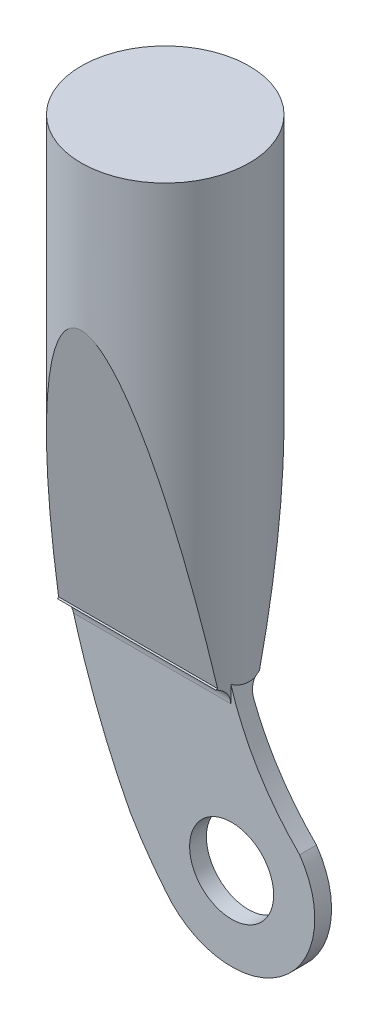
ISO-10303-21;
HEADER;
FILE_DESCRIPTION(('STEP AP214'),'2;1');
FILE_NAME('part.step','',(''),(''),'','','');
FILE_SCHEMA(('AUTOMOTIVE_DESIGN { 1 0 10303 214 1 1 1 1 }'));
ENDSEC;
DATA;
#1=APPLICATION_CONTEXT('core data for automotive mechanical design processes');
#2=APPLICATION_PROTOCOL_DEFINITION('international standard','automotive_design',2000,#1);
#3=PRODUCT_CONTEXT('',#1,'mechanical');
#4=PRODUCT('Part','Part','',(#3));
#5=PRODUCT_RELATED_PRODUCT_CATEGORY('part','',(#4));
#6=PRODUCT_DEFINITION_FORMATION('','',#4);
#7=PRODUCT_DEFINITION_CONTEXT('part definition',#1,'design');
#8=PRODUCT_DEFINITION('design','',#6,#7);
#9=PRODUCT_DEFINITION_SHAPE('','',#8);
#10=(LENGTH_UNIT() NAMED_UNIT(*) SI_UNIT(.MILLI.,.METRE.));
#11=(NAMED_UNIT(*) PLANE_ANGLE_UNIT() SI_UNIT($,.RADIAN.));
#12=(NAMED_UNIT(*) SI_UNIT($,.STERADIAN.) SOLID_ANGLE_UNIT());
#13=UNCERTAINTY_MEASURE_WITH_UNIT(LENGTH_MEASURE(1.E-05),#10,'distance_accuracy_value','');
#14=(GEOMETRIC_REPRESENTATION_CONTEXT(3) GLOBAL_UNCERTAINTY_ASSIGNED_CONTEXT((#13)) GLOBAL_UNIT_ASSIGNED_CONTEXT((#10,
#11,#12)) REPRESENTATION_CONTEXT('',''));
#15=CARTESIAN_POINT('',(0.,0.,0.));
#16=DIRECTION('',(0.,0.,1.));
#17=DIRECTION('',(1.,0.,0.));
#18=AXIS2_PLACEMENT_3D('',#15,#16,#17);
#19=CARTESIAN_POINT('',(0.,91.44,0.));
#20=DIRECTION('',(0.,-1.,0.));
#21=DIRECTION('',(0.,0.,-1.));
#22=AXIS2_PLACEMENT_3D('',#19,#20,#21);
#23=CYLINDRICAL_SURFACE('',#22,12.7);
#24=CARTESIAN_POINT('',(-11.9792612428708,24.1925238713067,4.21749926793753));
#25=CARTESIAN_POINT('',(-11.9544595647798,24.2179719688314,4.28796554173861));
#26=CARTESIAN_POINT('',(-11.9286612275636,24.2401703182906,4.35923748531561));
#27=CARTESIAN_POINT('',(-11.8753971879364,24.2779732207729,4.50229758863577));
#28=CARTESIAN_POINT('',(-11.8479444298377,24.2936228694024,4.57407863609307));
#29=CARTESIAN_POINT('',(-11.7913483766482,24.3185881679765,4.71805974046238));
#30=CARTESIAN_POINT('',(-11.7622052172247,24.3279043254696,4.7902597633311));
#31=CARTESIAN_POINT('',(-11.7021896226824,24.3403581149778,4.93507702613367));
#32=CARTESIAN_POINT('',(-11.6713064404358,24.3434517051435,5.00769361700132));
#33=CARTESIAN_POINT('',(-11.6397422651878,24.3434461230549,5.08));
#34=B_SPLINE_CURVE_WITH_KNOTS('',3,(#24,#25,#26,#27,#28,#29,#30,#31,#32,#33),.UNSPECIFIED.,.F.,
.F.,(4,2,2,2,4),(0.,0.236658753573695,0.471659888262691,0.706642188383265,0.943281866278754),.UNSPECIFIED.);
#35=CARTESIAN_POINT('',(-11.9792612428708,24.1925238713067,4.21749926793753));
#36=VERTEX_POINT('',#35);
#37=CARTESIAN_POINT('',(-11.9418212266587,24.2278225129843,4.32237270379623));
#38=VERTEX_POINT('',#37);
#39=EDGE_CURVE('E137',#36,#38,#34,.T.);
#40=ORIENTED_EDGE('',*,*,#39,.T.);
#41=CARTESIAN_POINT('',(0.,26.499274266038,0.));
#42=DIRECTION('',(0.,-0.885211887528532,-0.465188041740299));
#43=DIRECTION('',(0.,-0.465188041740299,0.885211887528532));
#44=AXIS2_PLACEMENT_3D('',#41,#42,#43);
#45=ELLIPSE('',#44,14.3468475502038,12.7);
#46=CARTESIAN_POINT('',(-12.0191811290624,24.343446123055,4.10235115352036));
#47=VERTEX_POINT('',#46);
#48=EDGE_CURVE('E60',#38,#47,#45,.T.);
#49=ORIENTED_EDGE('',*,*,#48,.T.);
#50=CARTESIAN_POINT('',(-12.0191811290624,24.3434461230549,4.10235115352036));
#51=CARTESIAN_POINT('',(-12.0125731375716,24.3184076860506,4.12170930271883));
#52=CARTESIAN_POINT('',(-12.0059424846436,24.2933116132361,4.1409840535195));
#53=CARTESIAN_POINT('',(-11.9926358559131,24.2430041959867,4.17936675832522));
#54=CARTESIAN_POINT('',(-11.9859598801105,24.2177928515518,4.19847471233028));
#55=CARTESIAN_POINT('',(-11.9792612428708,24.1925238713067,4.21749926793753));
#56=B_SPLINE_CURVE_WITH_KNOTS('',3,(#50,#51,#52,#53,#54,#55),.UNSPECIFIED.,.F.,.F.,(4,2,4),(0.,
0.0969930411241795,0.193986082248358),.UNSPECIFIED.);
#57=EDGE_CURVE('E276',#47,#36,#56,.T.);
#58=ORIENTED_EDGE('',*,*,#57,.T.);
#59=EDGE_LOOP('',(#40,#49,#58));
#60=FACE_BOUND('',#59,.T.);
#61=ADVANCED_FACE('F36',(#60),#23,.T.);
#62=CARTESIAN_POINT('',(0.,91.44,0.));
#63=DIRECTION('',(0.,1.,0.));
#64=DIRECTION('',(0.,0.,1.));
#65=AXIS2_PLACEMENT_3D('',#62,#63,#64);
#66=CIRCLE('',#65,12.7);
#67=CARTESIAN_POINT('',(0.,91.44,12.7));
#68=VERTEX_POINT('',#67);
#69=EDGE_CURVE('E249',#68,#68,#66,.T.);
#70=ORIENTED_EDGE('',*,*,#69,.F.);
#71=EDGE_LOOP('',(#70));
#72=FACE_BOUND('',#71,.T.);
#73=CARTESIAN_POINT('',(12.6704910337815,23.6373303550056,-0.865249653488732));
#74=CARTESIAN_POINT('',(12.6668670430806,23.6839098472634,-0.91835060117648));
#75=CARTESIAN_POINT('',(12.662771377319,23.7282446424918,-0.973384753406073));
#76=CARTESIAN_POINT('',(12.6535328393467,23.8121455961566,-1.08689212493601));
#77=CARTESIAN_POINT('',(12.6483899743442,23.8517117874133,-1.14536532056273));
#78=CARTESIAN_POINT('',(12.6369492040698,23.9258223999183,-1.26536540552183));
#79=CARTESIAN_POINT('',(12.6306505073291,23.9603633508404,-1.32689436613767));
#80=CARTESIAN_POINT('',(12.6168262160006,24.0241574344705,-1.45247950296735));
#81=CARTESIAN_POINT('',(12.6093006996775,24.0534109042412,-1.51653551777094));
#82=CARTESIAN_POINT('',(12.5847796574583,24.1329784855311,-1.71186107434401));
#83=CARTESIAN_POINT('',(12.5658369579399,24.1751177580963,-1.84631737989254));
#84=CARTESIAN_POINT('',(12.5226962533201,24.2364640326911,-2.11922187015697));
#85=CARTESIAN_POINT('',(12.4985110723698,24.255726264374,-2.25765961111056));
#86=CARTESIAN_POINT('',(12.4673119908407,24.2649495021567,-2.42007006520004));
#87=CARTESIAN_POINT('',(12.4626278084167,24.2659698049824,-2.4440768298692));
#88=CARTESIAN_POINT('',(12.4531216223503,24.2673281652256,-2.492058329634));
#89=CARTESIAN_POINT('',(12.4482997559183,24.2676668793689,-2.51603307329699));
#90=CARTESIAN_POINT('',(12.4434078933385,24.2676677468834,-2.54));
#91=B_SPLINE_CURVE_WITH_KNOTS('',3,(#73,#74,#75,#76,#77,#78,#79,#80,#81,#82,#83,#84,#85,#86,#87,
#88,#89,#90),.UNSPECIFIED.,.F.,.F.,(4,2,2,2,2,2,2,2,4),(0.,0.212117206964119,0.424232953931059,
0.636494495287167,0.848742500767856,1.27313651025069,1.69650385327587,1.76994268307384,
1.84331071895965),.UNSPECIFIED.);
#92=CARTESIAN_POINT('',(12.6704910337815,23.6373303550056,-0.865249653488732));
#93=VERTEX_POINT('',#92);
#94=CARTESIAN_POINT('',(12.5929767012208,24.1048659953085,-1.64527742417847));
#95=VERTEX_POINT('',#94);
#96=EDGE_CURVE('E140',#93,#95,#91,.T.);
#97=ORIENTED_EDGE('',*,*,#96,.T.);
#98=CARTESIAN_POINT('',(0.,17.9756886082944,0.));
#99=DIRECTION('',(0.,0.259255564221685,0.965808755613706));
#100=DIRECTION('',(0.,-0.965808755613706,0.259255564221685));
#101=AXIS2_PLACEMENT_3D('',#98,#99,#100);
#102=ELLIPSE('',#101,48.9864124541623,12.7);
#103=CARTESIAN_POINT('',(-12.5829504131552,24.3842695081639,-1.72027872743839));
#104=VERTEX_POINT('',#103);
#105=EDGE_CURVE('E53',#95,#104,#102,.T.);
#106=ORIENTED_EDGE('',*,*,#105,.T.);
#107=CARTESIAN_POINT('',(0.,23.4731190694692,0.));
#108=DIRECTION('',(0.072222411018197,0.99738855184262,0.));
#109=DIRECTION('',(0.99738855184262,-0.072222411018197,0.));
#110=AXIS2_PLACEMENT_3D('',#107,#108,#109);
#111=ELLIPSE('',#110,12.7332522280684,12.7);
#112=EDGE_CURVE('E291',#104,#47,#111,.T.);
#113=ORIENTED_EDGE('',*,*,#112,.T.);
#114=CARTESIAN_POINT('',(0.,2.78451448662995,0.));
#115=DIRECTION('',(0.,0.186931293119466,-0.982372990087108));
#116=DIRECTION('',(0.,-0.982372990087108,-0.186931293119466));
#117=AXIS2_PLACEMENT_3D('',#114,#115,#116);
#118=ELLIPSE('',#117,67.9394005576346,12.7);
#119=CARTESIAN_POINT('',(12.0191811290624,24.343446123055,4.10235115352036));
#120=VERTEX_POINT('',#119);
#121=EDGE_CURVE('E46',#47,#120,#118,.T.);
#122=ORIENTED_EDGE('',*,*,#121,.T.);
#123=CARTESIAN_POINT('',(11.9418212266587,24.2278225129843,4.32237270379623));
#124=VERTEX_POINT('',#123);
#125=EDGE_CURVE('E179',#120,#124,#45,.T.);
#126=ORIENTED_EDGE('',*,*,#125,.T.);
#127=CARTESIAN_POINT('',(11.6397422651878,24.3434461230549,5.08));
#128=CARTESIAN_POINT('',(11.6707782642724,24.3434431930043,5.00889572863439));
#129=CARTESIAN_POINT('',(11.7011451979248,24.3404579395367,4.93752843685327));
#130=CARTESIAN_POINT('',(11.7604054065534,24.3283888632447,4.79466778128157));
#131=CARTESIAN_POINT('',(11.78929811232,24.3193027037057,4.72317437965783));
#132=CARTESIAN_POINT('',(11.8735896382774,24.2826677148401,4.50902716655591));
#133=CARTESIAN_POINT('',(11.9265313009782,24.2457417676452,4.36686841340275));
#134=CARTESIAN_POINT('',(12.0248337543178,24.1465868267056,4.08843243372259));
#135=CARTESIAN_POINT('',(12.0701738314814,24.0842902333757,3.95217200465791));
#136=CARTESIAN_POINT('',(12.1525555977974,23.9353568519422,3.69108509029963));
#137=CARTESIAN_POINT('',(12.1896088528769,23.8487543733697,3.56624281444339));
#138=CARTESIAN_POINT('',(12.2536066487626,23.6589418195229,3.33949811777904));
#139=CARTESIAN_POINT('',(12.2810075442233,23.5569621986739,3.23669293344846));
#140=CARTESIAN_POINT('',(12.3288853517366,23.3359822713755,3.04925740573786));
#141=CARTESIAN_POINT('',(12.3493601405763,23.2169767614828,2.96463263849969));
#142=CARTESIAN_POINT('',(12.383300951377,22.9701625913942,2.81943869719712));
#143=CARTESIAN_POINT('',(12.3969956901135,22.842834344402,2.75810367015472));
#144=CARTESIAN_POINT('',(12.4189882100529,22.579411577688,2.65733195652849));
#145=CARTESIAN_POINT('',(12.4272907023038,22.4433248245943,2.61787615911992));
#146=CARTESIAN_POINT('',(12.4365603351185,22.2224009893618,2.57337214351356));
#147=CARTESIAN_POINT('',(12.4391357345041,22.1390590288149,2.56086357956999));
#148=CARTESIAN_POINT('',(12.4425548259849,21.9716393236424,2.54418049448413));
#149=CARTESIAN_POINT('',(12.4434011706943,21.8875629051122,2.53999320759663));
#150=CARTESIAN_POINT('',(12.4434078933385,21.8034461230549,2.54));
#151=B_SPLINE_CURVE_WITH_KNOTS('',3,(#127,#128,#129,#130,#131,#132,#133,#134,#135,#136,#137,
#138,#139,#140,#141,#142,#143,#144,#145,#146,#147,#148,#149,#150),.UNSPECIFIED.,.F.,.F.,(4,2,2,
2,2,2,2,2,2,2,2,4),(0.,0.232627457265038,0.465344064279462,0.931301197858615,1.39850807352043,
1.86505874111554,2.30497286835428,2.74502173026478,3.16899489545353,3.5925971476193,
3.84514744246824,4.09730999764686),.UNSPECIFIED.);
#152=CARTESIAN_POINT('',(12.4434078933385,21.8034461230549,2.54));
#153=VERTEX_POINT('',#152);
#154=EDGE_CURVE('E266',#124,#153,#151,.T.);
#155=ORIENTED_EDGE('',*,*,#154,.T.);
#156=DIRECTION('',(0.,-1.,0.));
#157=VECTOR('',#156,1.);
#158=CARTESIAN_POINT('',(12.4434078933385,24.3434461230549,2.54));
#159=LINE('',#158,#157);
#160=CARTESIAN_POINT('',(12.4434078933385,24.3434461230549,2.54));
#161=VERTEX_POINT('',#160);
#162=EDGE_CURVE('E308',#161,#153,#159,.T.);
#163=ORIENTED_EDGE('',*,*,#162,.F.);
#164=CARTESIAN_POINT('',(12.6149278604153,23.8063232498534,-1.46751322873694));
#165=CARTESIAN_POINT('',(12.6285681365037,23.7645566160981,-1.35038810318619));
#166=CARTESIAN_POINT('',(12.6407448433227,23.7274703545519,-1.2313797820451));
#167=CARTESIAN_POINT('',(12.6618999872545,23.6632621182339,-0.990368286431338));
#168=CARTESIAN_POINT('',(12.6708767999005,23.6361452043089,-0.868363624325526));
#169=CARTESIAN_POINT('',(12.6853327220945,23.5925647492651,-0.622488029109616));
#170=CARTESIAN_POINT('',(12.6908185236311,23.5760808247249,-0.498621135397063));
#171=CARTESIAN_POINT('',(12.6981517431261,23.5540610938075,-0.249836477243333));
#172=CARTESIAN_POINT('',(12.6999999942841,23.5485227802811,-0.124918960037815));
#173=CARTESIAN_POINT('',(12.7000000058072,23.5485227673012,0.126914404262686));
#174=CARTESIAN_POINT('',(12.6980922471506,23.554239417872,0.253830297821177));
#175=CARTESIAN_POINT('',(12.6905241606859,23.5769650471167,0.5065359930149));
#176=CARTESIAN_POINT('',(12.6848635845402,23.5939747730949,0.632325719569192));
#177=CARTESIAN_POINT('',(12.6699801287306,23.638853156403,0.881576617174056));
#178=CARTESIAN_POINT('',(12.6607613162605,23.6667094160684,1.00504027862273));
#179=CARTESIAN_POINT('',(12.6390374391956,23.7326620457131,1.24888583669687));
#180=CARTESIAN_POINT('',(12.6265326298832,23.7707576202256,1.369267971923));
#181=CARTESIAN_POINT('',(12.6015899245117,23.847195792787,1.58072974253849));
#182=CARTESIAN_POINT('',(12.5897165329631,23.8837216322536,1.67254112837194));
#183=CARTESIAN_POINT('',(12.5643412899316,23.9621903520137,1.85355799724091));
#184=CARTESIAN_POINT('',(12.5508398309891,24.0041319267013,1.94276410201317));
#185=CARTESIAN_POINT('',(12.5224030803164,24.0929941996577,2.11833056731073));
#186=CARTESIAN_POINT('',(12.5074689490381,24.1399108713345,2.20469315614994));
#187=CARTESIAN_POINT('',(12.484122994975,24.2137168720364,2.33206712051998));
#188=CARTESIAN_POINT('',(12.4761825189193,24.2388940028842,2.37416848598829));
#189=CARTESIAN_POINT('',(12.4600104828309,24.2903654190886,2.45763020424894));
#190=CARTESIAN_POINT('',(12.4517789075768,24.3166597628779,2.49899051812147));
#191=CARTESIAN_POINT('',(12.4349900427862,24.3703823544833,2.58123893232727));
#192=CARTESIAN_POINT('',(12.4264311885462,24.3978161234227,2.62212309582681));
#193=CARTESIAN_POINT('',(12.4090372192317,24.4535444924766,2.70324158344253));
#194=CARTESIAN_POINT('',(12.4002020942581,24.4818391234359,2.74347588419468));
#195=CARTESIAN_POINT('',(12.3733078760486,24.5679751014638,2.86320579786473));
#196=CARTESIAN_POINT('',(12.3548613688222,24.6270639574842,2.94172144909188));
#197=CARTESIAN_POINT('',(12.3170186361766,24.7482789640986,3.09635250198598));
#198=CARTESIAN_POINT('',(12.2976208260126,24.8104101825829,3.17246352545663));
#199=CARTESIAN_POINT('',(12.2580077663366,24.9372921579969,3.32223465352124));
#200=CARTESIAN_POINT('',(12.2377925664479,25.0020427559053,3.39589490640711));
#201=CARTESIAN_POINT('',(12.176024671609,25.1998889814436,3.61347322010771));
#202=CARTESIAN_POINT('',(12.1333730706119,25.3365041235655,3.75389444475062));
#203=CARTESIAN_POINT('',(12.044964498857,25.6196813107043,4.028650042228));
#204=CARTESIAN_POINT('',(11.999165792674,25.7663770408111,4.16283176250025));
#205=CARTESIAN_POINT('',(11.9056666924188,26.0658596411147,4.42314423818559));
#206=CARTESIAN_POINT('',(11.8579683152232,26.218640051218,4.5492831809304));
#207=CARTESIAN_POINT('',(11.7610001544589,26.5292341867117,4.79439534737216));
#208=CARTESIAN_POINT('',(11.7117309699185,26.6870459933758,4.91337125386452));
#209=CARTESIAN_POINT('',(11.583281754744,27.0984756254802,5.21123440994157));
#210=CARTESIAN_POINT('',(11.5031310023764,27.3552027212177,5.38541154037422));
#211=CARTESIAN_POINT('',(11.3403147409548,27.8767118137867,5.72030710063059));
#212=CARTESIAN_POINT('',(11.2576474688318,28.1414994578233,5.8810157842079));
#213=CARTESIAN_POINT('',(11.0902508954397,28.6776795336178,6.19091193062888));
#214=CARTESIAN_POINT('',(11.0055184849831,28.9490819242665,6.34008040358227));
#215=CARTESIAN_POINT('',(10.8343770958501,29.4972568423953,6.62830272826664));
#216=CARTESIAN_POINT('',(10.7479656551618,29.7740372558301,6.767340041725));
#217=CARTESIAN_POINT('',(10.5737972563509,30.331907846136,7.03637055946258));
#218=CARTESIAN_POINT('',(10.4860390003706,30.6130021801138,7.16635427163756));
#219=CARTESIAN_POINT('',(10.317019815474,31.1543795659611,7.4073521208407));
#220=CARTESIAN_POINT('',(10.2358436779193,31.414391026615,7.51903840892493));
#221=CARTESIAN_POINT('',(10.0728304410619,31.9365310433461,7.73605108755233));
#222=CARTESIAN_POINT('',(9.99099404256284,32.1986573547119,7.84138341640035));
#223=CARTESIAN_POINT('',(9.82687910222656,32.7243261859345,8.04609291363056));
#224=CARTESIAN_POINT('',(9.74460202133049,32.9878640263192,8.14548329571525));
#225=CARTESIAN_POINT('',(9.57981833841969,33.5156748753673,8.338653864072));
#226=CARTESIAN_POINT('',(9.49731380945684,33.7799412439357,8.43245400640628));
#227=CARTESIAN_POINT('',(9.33227992701245,34.3085534953185,8.61472760056482));
#228=CARTESIAN_POINT('',(9.24975314176971,34.5728911519282,8.70322721439128));
#229=CARTESIAN_POINT('',(9.16702435324628,34.8378758357267,8.78952015226028));
#230=B_SPLINE_CURVE_WITH_KNOTS('',3,(#164,#165,#166,#167,#168,#169,#170,#171,#172,#173,#174,
#175,#176,#177,#178,#179,#180,#181,#182,#183,#184,#185,#186,#187,#188,#189,#190,#191,#192,#193,
#194,#195,#196,#197,#198,#199,#200,#201,#202,#203,#204,#205,#206,#207,#208,#209,#210,#211,#212,
#213,#214,#215,#216,#217,#218,#219,#220,#221,#222,#223,#224,#225,#226,#227,#228,#229),
.UNSPECIFIED.,.F.,.F.,(4,2,2,2,2,2,2,2,2,2,2,2,2,2,2,2,2,2,2,2,2,2,2,2,2,2,2,2,2,2,2,2,4),(0.,
0.375238266556501,0.750666757173332,1.12537339624537,1.49999419686089,1.88059915642937,
2.2612293045382,2.64142566082697,3.02159248915012,3.31996218597721,3.61826008674482,
3.91631837679222,4.06538409136868,4.21445761201985,4.36436520773448,4.51427818101949,
4.81412949169765,5.11449850978333,5.4148493198801,6.01591839882954,6.62767650390474,
7.23880157140861,7.84969630981574,8.81044245011257,9.77187792304854,10.734863235866,
11.699386871018,12.6649069804621,13.5480139779959,14.4302824262308,15.3105097129908,
16.1873789843213,17.0594860900568),.UNSPECIFIED.);
#231=EDGE_CURVE('E217',#93,#161,#230,.T.);
#232=ORIENTED_EDGE('',*,*,#231,.F.);
#233=EDGE_LOOP('',(#97,#106,#113,#122,#126,#155,#163,#232));
#234=FACE_BOUND('',#233,.T.);
#235=ADVANCED_FACE('F253',(#72,#234),#23,.T.);
#236=CARTESIAN_POINT('',(0.,91.44,0.));
#237=DIRECTION('',(0.,1.,0.));
#238=DIRECTION('',(0.,0.,1.));
#239=AXIS2_PLACEMENT_3D('',#236,#237,#238);
#240=PLANE('',#239);
#241=ORIENTED_EDGE('',*,*,#69,.T.);
#242=EDGE_LOOP('',(#241));
#243=FACE_BOUND('',#242,.T.);
#244=ADVANCED_FACE('F257',(#243),#240,.T.);
#245=CARTESIAN_POINT('',(0.,0.,0.));
#246=DIRECTION('',(0.,0.,1.));
#247=DIRECTION('',(1.,0.,0.));
#248=AXIS2_PLACEMENT_3D('',#245,#246,#247);
#249=PLANE('',#248);
#250=CARTESIAN_POINT('',(12.5717039466693,0.,0.));
#251=DIRECTION('',(0.,0.,-1.));
#252=DIRECTION('',(-1.,0.,0.));
#253=AXIS2_PLACEMENT_3D('',#250,#251,#252);
#254=CIRCLE('',#253,6.35);
#255=CARTESIAN_POINT('',(6.22170394666927,0.,0.));
#256=VERTEX_POINT('',#255);
#257=EDGE_CURVE('E480',#256,#256,#254,.T.);
#258=ORIENTED_EDGE('',*,*,#257,.F.);
#259=EDGE_LOOP('',(#258));
#260=FACE_BOUND('',#259,.T.);
#261=CARTESIAN_POINT('',(-2.76109879600005,0.,0.));
#262=CARTESIAN_POINT('',(-8.46277228087428,10.8679601910392,0.));
#263=CARTESIAN_POINT('',(-12.0191811290624,24.3434461230549,0.));
#264=B_SPLINE_CURVE_WITH_KNOTS('',2,(#261,#262,#263),.UNSPECIFIED.,.F.,.F.,(3,3),(0.,1.),.UNSPECIFIED.);
#265=CARTESIAN_POINT('',(-2.76109879600005,0.,0.));
#266=VERTEX_POINT('',#265);
#267=CARTESIAN_POINT('',(-11.3016284871646,21.7276677468871,0.));
#268=VERTEX_POINT('',#267);
#269=EDGE_CURVE('E193',#266,#268,#264,.T.);
#270=ORIENTED_EDGE('',*,*,#269,.T.);
#271=DIRECTION('',(-1.,0.,0.));
#272=VECTOR('',#271,1.);
#273=CARTESIAN_POINT('',(12.7,21.7276677468834,0.));
#274=LINE('',#273,#272);
#275=CARTESIAN_POINT('',(13.3534438081836,21.7276677468845,0.));
#276=VERTEX_POINT('',#275);
#277=EDGE_CURVE('E135',#268,#276,#274,.F.);
#278=ORIENTED_EDGE('',*,*,#277,.T.);
#279=CARTESIAN_POINT('',(12.4434078933385,24.3434461230549,0.));
#280=CARTESIAN_POINT('',(15.5042126598783,14.5395266204688,0.));
#281=CARTESIAN_POINT('',(22.8507584754909,7.23800926472261,0.));
#282=B_SPLINE_CURVE_WITH_KNOTS('',2,(#279,#280,#281),.UNSPECIFIED.,.F.,.F.,(3,3),(0.,1.),.UNSPECIFIED.);
#283=CARTESIAN_POINT('',(22.8507584754909,7.23800926472261,0.));
#284=VERTEX_POINT('',#283);
#285=EDGE_CURVE('E212',#284,#276,#282,.F.);
#286=ORIENTED_EDGE('',*,*,#285,.F.);
#287=CARTESIAN_POINT('',(12.5717039466693,0.,0.));
#288=DIRECTION('',(0.,0.,1.));
#289=DIRECTION('',(1.,0.,0.));
#290=AXIS2_PLACEMENT_3D('',#287,#288,#289);
#291=CIRCLE('',#290,12.5717039466693);
#292=CARTESIAN_POINT('',(2.52125290099714,-7.55222973043376,0.));
#293=VERTEX_POINT('',#292);
#294=EDGE_CURVE('E206',#284,#293,#291,.F.);
#295=ORIENTED_EDGE('',*,*,#294,.T.);
#296=CARTESIAN_POINT('',(-12.0191811290624,24.3434461230549,0.));
#297=CARTESIAN_POINT('',(-7.69626836414799,4.88193975760914,0.));
#298=CARTESIAN_POINT('',(2.52125290099714,-7.55222973043376,0.));
#299=B_SPLINE_CURVE_WITH_KNOTS('',2,(#296,#297,#298),.UNSPECIFIED.,.F.,.F.,(3,3),(0.,1.),.UNSPECIFIED.);
#300=EDGE_CURVE('E198',#293,#266,#299,.F.);
#301=ORIENTED_EDGE('',*,*,#300,.T.);
#302=EDGE_LOOP('',(#270,#278,#286,#295,#301));
#303=FACE_BOUND('',#302,.T.);
#304=ADVANCED_FACE('F317',(#260,#303),#249,.F.);
#305=CARTESIAN_POINT('',(0.,0.,2.54));
#306=DIRECTION('',(0.,0.,1.));
#307=DIRECTION('',(1.,0.,0.));
#308=AXIS2_PLACEMENT_3D('',#305,#306,#307);
#309=PLANE('',#308);
#310=CARTESIAN_POINT('',(12.5717039466693,0.,2.54));
#311=DIRECTION('',(0.,0.,1.));
#312=DIRECTION('',(1.,0.,0.));
#313=AXIS2_PLACEMENT_3D('',#310,#311,#312);
#314=CIRCLE('',#313,6.35);
#315=CARTESIAN_POINT('',(18.9217039466693,0.,2.54));
#316=VERTEX_POINT('',#315);
#317=EDGE_CURVE('E41',#316,#316,#314,.T.);
#318=ORIENTED_EDGE('',*,*,#317,.F.);
#319=EDGE_LOOP('',(#318));
#320=FACE_BOUND('',#319,.T.);
#321=CARTESIAN_POINT('',(12.4434078933385,24.3434461230549,2.54));
#322=CARTESIAN_POINT('',(15.5042126598783,14.5395266204688,2.54));
#323=CARTESIAN_POINT('',(22.8507584754909,7.23800926472261,2.54));
#324=B_SPLINE_CURVE_WITH_KNOTS('',2,(#321,#322,#323),.UNSPECIFIED.,.F.,.F.,(3,3),(0.,1.),.UNSPECIFIED.);
#325=CARTESIAN_POINT('',(22.8507584754909,7.23800926472261,2.54));
#326=VERTEX_POINT('',#325);
#327=EDGE_CURVE('E197',#161,#326,#324,.T.);
#328=ORIENTED_EDGE('',*,*,#327,.F.);
#329=ORIENTED_EDGE('',*,*,#162,.T.);
#330=DIRECTION('',(1.,0.,0.));
#331=VECTOR('',#330,1.);
#332=CARTESIAN_POINT('',(0.,21.8034461230549,2.54));
#333=LINE('',#332,#331);
#334=CARTESIAN_POINT('',(-11.3231954147127,21.8034461230537,2.54));
#335=VERTEX_POINT('',#334);
#336=EDGE_CURVE('E310',#153,#335,#333,.F.);
#337=ORIENTED_EDGE('',*,*,#336,.T.);
#338=CARTESIAN_POINT('',(-2.76109879600005,0.,2.54));
#339=CARTESIAN_POINT('',(-8.46277228087428,10.8679601910392,2.54));
#340=CARTESIAN_POINT('',(-12.0191811290624,24.3434461230549,2.54));
#341=B_SPLINE_CURVE_WITH_KNOTS('',2,(#338,#339,#340),.UNSPECIFIED.,.F.,.F.,(3,3),(0.,1.),.UNSPECIFIED.);
#342=CARTESIAN_POINT('',(-2.76109879600005,0.,2.54));
#343=VERTEX_POINT('',#342);
#344=EDGE_CURVE('E181',#343,#335,#341,.T.);
#345=ORIENTED_EDGE('',*,*,#344,.F.);
#346=CARTESIAN_POINT('',(-12.0191811290624,24.3434461230549,2.54));
#347=CARTESIAN_POINT('',(-7.69626836414799,4.88193975760914,2.54));
#348=CARTESIAN_POINT('',(2.52125290099714,-7.55222973043376,2.54));
#349=B_SPLINE_CURVE_WITH_KNOTS('',2,(#346,#347,#348),.UNSPECIFIED.,.F.,.F.,(3,3),(0.,1.),.UNSPECIFIED.);
#350=CARTESIAN_POINT('',(2.52125290099714,-7.55222973043376,2.54));
#351=VERTEX_POINT('',#350);
#352=EDGE_CURVE('E494',#343,#351,#349,.T.);
#353=ORIENTED_EDGE('',*,*,#352,.T.);
#354=CARTESIAN_POINT('',(12.5717039466693,0.,2.54));
#355=DIRECTION('',(0.,0.,1.));
#356=DIRECTION('',(1.,0.,0.));
#357=AXIS2_PLACEMENT_3D('',#354,#355,#356);
#358=CIRCLE('',#357,12.5717039466693);
#359=EDGE_CURVE('E491',#351,#326,#358,.T.);
#360=ORIENTED_EDGE('',*,*,#359,.T.);
#361=EDGE_LOOP('',(#328,#329,#337,#345,#353,#360));
#362=FACE_BOUND('',#361,.T.);
#363=ADVANCED_FACE('F237',(#320,#362),#309,.T.);
#364=CARTESIAN_POINT('',(12.4434078933385,24.3434461230549,-46.2751531432998));
#365=CARTESIAN_POINT('',(15.5042126598783,14.5395266204688,-46.2751531432998));
#366=CARTESIAN_POINT('',(22.8507584754909,7.23800926472261,-46.2751531432998));
#367=B_SPLINE_CURVE_WITH_KNOTS('',2,(#364,#365,#366),.UNSPECIFIED.,.F.,.F.,(3,3),(0.,1.),.UNSPECIFIED.);
#368=DIRECTION('',(0.,0.,1.));
#369=VECTOR('',#368,1.);
#370=SURFACE_OF_LINEAR_EXTRUSION('',#367,#369);
#371=ORIENTED_EDGE('',*,*,#285,.T.);
#372=CARTESIAN_POINT('',(13.3534438081854,21.7276677468834,0.));
#373=CARTESIAN_POINT('',(13.3249453162652,21.8017089130876,-3.89739535312748E-06));
#374=CARTESIAN_POINT('',(13.2966716087575,21.8757991802464,-0.00323975933376816));
#375=CARTESIAN_POINT('',(13.240722506069,22.0236536523647,-0.016210883685585));
#376=CARTESIAN_POINT('',(13.21304724423,22.0974177818021,-0.0259475794774646));
#377=CARTESIAN_POINT('',(13.1310357028883,22.3178721965995,-0.0650197619508123));
#378=CARTESIAN_POINT('',(13.0778460585846,22.463380210484,-0.104217714332159));
#379=CARTESIAN_POINT('',(12.9759308260977,22.7467536756564,-0.208489254452779));
#380=CARTESIAN_POINT('',(12.9272140345147,22.8846038649354,-0.27361254165002));
#381=CARTESIAN_POINT('',(12.8356879047104,23.1475225052694,-0.428425669175792));
#382=CARTESIAN_POINT('',(12.7928605301962,23.2726296620957,-0.518037874596137));
#383=CARTESIAN_POINT('',(12.7386615030532,23.4330555360735,-0.656743623902661));
#384=CARTESIAN_POINT('',(12.7242983429082,23.475806446681,-0.696354882685805));
#385=CARTESIAN_POINT('',(12.6966104329859,23.5586214877161,-0.77857960972587));
#386=CARTESIAN_POINT('',(12.6832850599724,23.5986872286563,-0.821191246385147));
#387=CARTESIAN_POINT('',(12.6704910337815,23.6373303550057,-0.865249653488651));
#388=B_SPLINE_CURVE_WITH_KNOTS('',3,(#372,#373,#374,#375,#376,#377,#378,#379,#380,#381,#382,
#383,#384,#385,#386,#387),.UNSPECIFIED.,.F.,.F.,(4,2,2,2,2,2,2,4),(0.,0.237870740541042,
0.475793946882115,0.952733439202169,1.43059167250198,1.9069522274455,2.08691340334687,
2.26676565776633),.UNSPECIFIED.);
#389=EDGE_CURVE('E136',#276,#93,#388,.T.);
#390=ORIENTED_EDGE('',*,*,#389,.T.);
#391=ORIENTED_EDGE('',*,*,#231,.T.);
#392=ORIENTED_EDGE('',*,*,#327,.T.);
#393=DIRECTION('',(0.,0.,1.));
#394=VECTOR('',#393,1.);
#395=CARTESIAN_POINT('',(22.8507584754909,7.23800926472261,-46.2751531432998));
#396=LINE('',#395,#394);
#397=EDGE_CURVE('E207',#284,#326,#396,.T.);
#398=ORIENTED_EDGE('',*,*,#397,.F.);
#399=EDGE_LOOP('',(#371,#390,#391,#392,#398));
#400=FACE_BOUND('',#399,.T.);
#401=ADVANCED_FACE('F232',(#400),#370,.F.);
#402=CARTESIAN_POINT('',(-12.0191811290624,24.3434461230549,-46.2751531432998));
#403=CARTESIAN_POINT('',(-7.69626836414799,4.88193975760914,-46.2751531432998));
#404=CARTESIAN_POINT('',(2.52125290099714,-7.55222973043376,-46.2751531432998));
#405=B_SPLINE_CURVE_WITH_KNOTS('',2,(#402,#403,#404),.UNSPECIFIED.,.F.,.F.,(3,3),(0.,1.),.UNSPECIFIED.);
#406=DIRECTION('',(0.,0.,1.));
#407=VECTOR('',#406,1.);
#408=SURFACE_OF_LINEAR_EXTRUSION('',#405,#407);
#409=ORIENTED_EDGE('',*,*,#300,.F.);
#410=DIRECTION('',(0.,0.,1.));
#411=VECTOR('',#410,1.);
#412=CARTESIAN_POINT('',(2.52125290099714,-7.55222973043376,-46.2751531432998));
#413=LINE('',#412,#411);
#414=EDGE_CURVE('E489',#293,#351,#413,.T.);
#415=ORIENTED_EDGE('',*,*,#414,.T.);
#416=ORIENTED_EDGE('',*,*,#352,.F.);
#417=DIRECTION('',(0.,0.,1.));
#418=VECTOR('',#417,1.);
#419=CARTESIAN_POINT('',(-2.76109879600005,0.,-46.2751531432998));
#420=LINE('',#419,#418);
#421=EDGE_CURVE('E250',#266,#343,#420,.T.);
#422=ORIENTED_EDGE('',*,*,#421,.F.);
#423=EDGE_LOOP('',(#409,#415,#416,#422));
#424=FACE_BOUND('',#423,.T.);
#425=ADVANCED_FACE('F236',(#424),#408,.T.);
#426=CARTESIAN_POINT('',(12.5717039466693,0.,-46.2751531432998));
#427=DIRECTION('',(0.,0.,1.));
#428=DIRECTION('',(1.,0.,0.));
#429=AXIS2_PLACEMENT_3D('',#426,#427,#428);
#430=CYLINDRICAL_SURFACE('',#429,12.5717039466693);
#431=ORIENTED_EDGE('',*,*,#294,.F.);
#432=ORIENTED_EDGE('',*,*,#397,.T.);
#433=ORIENTED_EDGE('',*,*,#359,.F.);
#434=ORIENTED_EDGE('',*,*,#414,.F.);
#435=EDGE_LOOP('',(#431,#432,#433,#434));
#436=FACE_BOUND('',#435,.T.);
#437=ADVANCED_FACE('F170',(#436),#430,.T.);
#438=CARTESIAN_POINT('',(-12.0191811290624,24.3434461230549,-8.46));
#439=DIRECTION('',(0.072222411018197,0.99738855184262,0.));
#440=DIRECTION('',(-0.99738855184262,0.072222411018197,0.));
#441=AXIS2_PLACEMENT_3D('',#438,#439,#440);
#442=PLANE('',#441);
#443=ORIENTED_EDGE('',*,*,#112,.F.);
#444=DIRECTION('',(0.997201168991733,-0.0722088423430307,0.0193832827199226));
#445=VECTOR('',#444,1.);
#446=CARTESIAN_POINT('',(-12.1496652331599,24.3528946740535,-1.71185666637052));
#447=LINE('',#446,#445);
#448=CARTESIAN_POINT('',(-12.0191811290624,24.3434461230549,-1.70932035739012));
#449=VERTEX_POINT('',#448);
#450=EDGE_CURVE('E131',#104,#449,#447,.T.);
#451=ORIENTED_EDGE('',*,*,#450,.T.);
#452=DIRECTION('',(0.,0.,1.));
#453=VECTOR('',#452,1.);
#454=CARTESIAN_POINT('',(-12.0191811290624,24.3434461230549,-8.46));
#455=LINE('',#454,#453);
#456=EDGE_CURVE('E130',#449,#47,#455,.T.);
#457=ORIENTED_EDGE('',*,*,#456,.T.);
#458=EDGE_LOOP('',(#443,#451,#457));
#459=FACE_BOUND('',#458,.T.);
#460=ADVANCED_FACE('F168',(#459),#442,.F.);
#461=CARTESIAN_POINT('',(-2.76109879600005,0.,-8.46));
#462=CARTESIAN_POINT('',(-8.46277228087428,10.8679601910392,-8.46));
#463=CARTESIAN_POINT('',(-12.0191811290624,24.3434461230549,-8.46));
#464=B_SPLINE_CURVE_WITH_KNOTS('',2,(#461,#462,#463),.UNSPECIFIED.,.F.,.F.,(3,3),(0.,1.),.UNSPECIFIED.);
#465=DIRECTION('',(0.,0.,1.));
#466=VECTOR('',#465,1.);
#467=SURFACE_OF_LINEAR_EXTRUSION('',#464,#466);
#468=ORIENTED_EDGE('',*,*,#456,.F.);
#469=CARTESIAN_POINT('',(-12.0191811290624,24.3434461230549,-1.70932035739012));
#470=CARTESIAN_POINT('',(-12.008684659947,24.3036741653343,-1.69864422582769));
#471=CARTESIAN_POINT('',(-11.9981707790247,24.2639065091617,-1.68796924894551));
#472=CARTESIAN_POINT('',(-11.9771081935661,24.1843797999129,-1.66662160454162));
#473=CARTESIAN_POINT('',(-11.9665594890299,24.1446207468366,-1.65594893701992));
#474=CARTESIAN_POINT('',(-11.9559933726867,24.1048659953085,-1.64527742417847));
#475=B_SPLINE_CURVE_WITH_KNOTS('',3,(#469,#470,#471,#472,#473,#474),.UNSPECIFIED.,.F.,.F.,(4,2,
4),(0.,0.1274898808082,0.254979761616393),.UNSPECIFIED.);
#476=CARTESIAN_POINT('',(-11.9559933726889,24.1048659953085,-1.64527742417847));
#477=VERTEX_POINT('',#476);
#478=EDGE_CURVE('E117',#449,#477,#475,.T.);
#479=ORIENTED_EDGE('',*,*,#478,.T.);
#480=CARTESIAN_POINT('',(-11.9991595202739,24.2676677468834,-2.54));
#481=CARTESIAN_POINT('',(-11.9991612458971,24.2676757928784,-2.47031499465313));
#482=CARTESIAN_POINT('',(-11.9984009998679,24.2648001275729,-2.4006339140092));
#483=CARTESIAN_POINT('',(-11.9953700174389,24.2533433146554,-2.26178294534699));
#484=CARTESIAN_POINT('',(-11.993099448135,24.2447627982045,-2.19261300163452));
#485=CARTESIAN_POINT('',(-11.9870662025054,24.2219768395627,-2.05538428379203));
#486=CARTESIAN_POINT('',(-11.9833059717029,24.2077806165302,-1.98732387788998));
#487=CARTESIAN_POINT('',(-11.9743235336781,24.1738986968325,-1.85270169853294));
#488=CARTESIAN_POINT('',(-11.9691013269077,24.1542130018649,-1.78613992461452));
#489=CARTESIAN_POINT('',(-11.951287077198,24.087133414246,-1.58938057130198));
#490=CARTESIAN_POINT('',(-11.9365430106104,24.0317003493477,-1.46200954139394));
#491=CARTESIAN_POINT('',(-11.9017382092613,23.9012825695178,-1.21860021493149));
#492=CARTESIAN_POINT('',(-11.8816770873146,23.8262964307481,-1.10256274452343));
#493=CARTESIAN_POINT('',(-11.8364543284943,23.6579538510741,-0.883208951147277));
#494=CARTESIAN_POINT('',(-11.811226940659,23.5643611048137,-0.780087427438163));
#495=CARTESIAN_POINT('',(-11.7564999793507,23.3623045916285,-0.590968433181347));
#496=CARTESIAN_POINT('',(-11.7269994535509,23.2538375100444,-0.504974789987076));
#497=CARTESIAN_POINT('',(-11.6634705549307,23.0215004972292,-0.349625232064034));
#498=CARTESIAN_POINT('',(-11.6293281024904,22.897250678347,-0.280884742256565));
#499=CARTESIAN_POINT('',(-11.5581516256156,22.6397540989284,-0.165212691386688));
#500=CARTESIAN_POINT('',(-11.5211177294353,22.5065077374822,-0.11828016364146));
#501=CARTESIAN_POINT('',(-11.4537157519007,22.2654799972986,-0.0552106903076814));
#502=CARTESIAN_POINT('',(-11.4237350349605,22.1587571446363,-0.0345088898870072));
#503=CARTESIAN_POINT('',(-11.3630940141868,21.9439066181256,-0.0069034047315379));
#504=CARTESIAN_POINT('',(-11.3324347992458,21.8357812962435,2.09672859029225E-05));
#505=CARTESIAN_POINT('',(-11.3016284871635,21.7276677468833,0.));
#506=B_SPLINE_CURVE_WITH_KNOTS('',3,(#480,#481,#482,#483,#484,#485,#486,#487,#488,#489,#490,
#491,#492,#493,#494,#495,#496,#497,#498,#499,#500,#501,#502,#503,#504,#505),.UNSPECIFIED.,.F.,
.F.,(4,2,2,2,2,2,2,2,2,2,2,2,4),(0.,0.208984669312822,0.417946221274343,0.626566140797042,
0.835185995808194,1.25212681467466,1.66909800329963,2.09174864851292,2.51449363248704,
2.95067014412862,3.38682731950341,3.72431367642111,4.06129290239132),.UNSPECIFIED.);
#507=EDGE_CURVE('E126',#477,#268,#506,.T.);
#508=ORIENTED_EDGE('',*,*,#507,.T.);
#509=ORIENTED_EDGE('',*,*,#269,.F.);
#510=ORIENTED_EDGE('',*,*,#421,.T.);
#511=ORIENTED_EDGE('',*,*,#344,.T.);
#512=CARTESIAN_POINT('',(-11.3231954147127,21.8034461230549,2.54));
#513=CARTESIAN_POINT('',(-11.3440393987842,21.8767636442406,2.54000210302736));
#514=CARTESIAN_POINT('',(-11.3648114709474,21.9500649867188,2.54317641671949));
#515=CARTESIAN_POINT('',(-11.406091279636,22.0961963649928,2.55585976303121));
#516=CARTESIAN_POINT('',(-11.4265990019723,22.169026375386,2.56536913425756));
#517=CARTESIAN_POINT('',(-11.4875248607908,22.3860797869734,2.60337437963014));
#518=CARTESIAN_POINT('',(-11.5273629791296,22.528927410187,2.64134740551043));
#519=CARTESIAN_POINT('',(-11.6043389454212,22.806585249941,2.74180514777593));
#520=CARTESIAN_POINT('',(-11.6414744172514,22.9413883755874,2.80431113176145));
#521=CARTESIAN_POINT('',(-11.711989646622,23.1987528401409,2.95238900584483));
#522=CARTESIAN_POINT('',(-11.7453707421071,23.3213185383331,3.03795264174985));
#523=CARTESIAN_POINT('',(-11.8067906360523,23.5479019455049,3.2279976899375));
#524=CARTESIAN_POINT('',(-11.8349238448466,23.6522447096426,3.33206139539483));
#525=CARTESIAN_POINT('',(-11.8858431121179,23.8418170047305,3.55741668304169));
#526=CARTESIAN_POINT('',(-11.9086348579467,23.9270668606276,3.67868971849683));
#527=CARTESIAN_POINT('',(-11.9385011727779,24.0390947766483,3.87202548478233));
#528=CARTESIAN_POINT('',(-11.9478085786779,24.0740696127732,3.9391227690642));
#529=CARTESIAN_POINT('',(-11.9647769571649,24.137915342782,4.07622780372066));
#530=CARTESIAN_POINT('',(-11.9724405346998,24.1667958929846,4.14623073624699));
#531=CARTESIAN_POINT('',(-11.9792612428708,24.1925238713067,4.21749926793753));
#532=B_SPLINE_CURVE_WITH_KNOTS('',3,(#512,#513,#514,#515,#516,#517,#518,#519,#520,#521,#522,
#523,#524,#525,#526,#527,#528,#529,#530,#531),.UNSPECIFIED.,.F.,.F.,(4,2,2,2,2,2,2,2,2,4),(0.,
0.22853177351771,0.457075762964045,0.913976360609785,1.37127392295495,1.82840799859689,
2.27629459825726,2.72370211931621,2.95213179820665,3.18019676932027),.UNSPECIFIED.);
#533=EDGE_CURVE('E143',#335,#36,#532,.T.);
#534=ORIENTED_EDGE('',*,*,#533,.T.);
#535=ORIENTED_EDGE('',*,*,#57,.F.);
#536=EDGE_LOOP('',(#468,#479,#508,#509,#510,#511,#534,#535));
#537=FACE_BOUND('',#536,.T.);
#538=ADVANCED_FACE('F125',(#537),#467,.F.);
#539=CARTESIAN_POINT('',(-12.0191811290624,21.8034461230549,5.08));
#540=DIRECTION('',(1.,0.,0.));
#541=DIRECTION('',(0.,0.,-1.));
#542=AXIS2_PLACEMENT_3D('',#539,#540,#541);
#543=CYLINDRICAL_SURFACE('',#542,2.54);
#544=ORIENTED_EDGE('',*,*,#154,.F.);
#545=DIRECTION('',(1.,0.,0.));
#546=VECTOR('',#545,1.);
#547=CARTESIAN_POINT('',(-12.0191811290624,24.2278225129843,4.32237270379623));
#548=LINE('',#547,#546);
#549=EDGE_CURVE('E283',#124,#38,#548,.F.);
#550=ORIENTED_EDGE('',*,*,#549,.T.);
#551=ORIENTED_EDGE('',*,*,#39,.F.);
#552=ORIENTED_EDGE('',*,*,#533,.F.);
#553=ORIENTED_EDGE('',*,*,#336,.F.);
#554=EDGE_LOOP('',(#544,#550,#551,#552,#553));
#555=FACE_BOUND('',#554,.T.);
#556=ADVANCED_FACE('F167',(#555),#543,.F.);
#557=CARTESIAN_POINT('',(-19.6692777213343,21.7276677468834,-2.54));
#558=DIRECTION('',(1.,0.,0.));
#559=DIRECTION('',(0.,0.,-1.));
#560=AXIS2_PLACEMENT_3D('',#557,#558,#559);
#561=CYLINDRICAL_SURFACE('',#560,2.54);
#562=ORIENTED_EDGE('',*,*,#507,.F.);
#563=DIRECTION('',(1.,0.,0.));
#564=VECTOR('',#563,1.);
#565=CARTESIAN_POINT('',(-19.6692777213343,24.1048659953085,-1.64527742417847));
#566=LINE('',#565,#564);
#567=EDGE_CURVE('E11',#477,#95,#566,.T.);
#568=ORIENTED_EDGE('',*,*,#567,.T.);
#569=ORIENTED_EDGE('',*,*,#96,.F.);
#570=ORIENTED_EDGE('',*,*,#389,.F.);
#571=ORIENTED_EDGE('',*,*,#277,.F.);
#572=EDGE_LOOP('',(#562,#568,#569,#570,#571));
#573=FACE_BOUND('',#572,.T.);
#574=ADVANCED_FACE('F38',(#573),#561,.F.);
#575=CARTESIAN_POINT('',(-16.93,24.343446123055,4.10235115352036));
#576=DIRECTION('',(0.,0.186931293119466,-0.982372990087108));
#577=DIRECTION('',(0.,0.982372990087108,0.186931293119466));
#578=AXIS2_PLACEMENT_3D('',#575,#576,#577);
#579=PLANE('',#578);
#580=DIRECTION('',(1.,0.,0.));
#581=VECTOR('',#580,1.);
#582=CARTESIAN_POINT('',(-16.93,24.343446123055,4.10235115352036));
#583=LINE('',#582,#581);
#584=EDGE_CURVE('E295',#47,#120,#583,.T.);
#585=ORIENTED_EDGE('',*,*,#584,.T.);
#586=ORIENTED_EDGE('',*,*,#121,.F.);
#587=EDGE_LOOP('',(#585,#586));
#588=FACE_BOUND('',#587,.T.);
#589=ADVANCED_FACE('F294',(#588),#579,.F.);
#590=CARTESIAN_POINT('',(-16.93,13.5464542051961,24.6480761886748));
#591=DIRECTION('',(0.,-0.885211887528532,-0.465188041740299));
#592=DIRECTION('',(0.,0.465188041740299,-0.885211887528532));
#593=AXIS2_PLACEMENT_3D('',#590,#591,#592);
#594=PLANE('',#593);
#595=ORIENTED_EDGE('',*,*,#549,.F.);
#596=ORIENTED_EDGE('',*,*,#125,.F.);
#597=ORIENTED_EDGE('',*,*,#584,.F.);
#598=ORIENTED_EDGE('',*,*,#48,.F.);
#599=EDGE_LOOP('',(#595,#596,#597,#598));
#600=FACE_BOUND('',#599,.T.);
#601=ADVANCED_FACE('F296',(#600),#594,.F.);
#602=CARTESIAN_POINT('',(-16.93,24.1048659953085,-1.64527742417847));
#603=DIRECTION('',(0.,0.259255564221685,0.965808755613706));
#604=DIRECTION('',(0.,-0.965808755613706,0.259255564221685));
#605=AXIS2_PLACEMENT_3D('',#602,#603,#604);
#606=PLANE('',#605);
#607=ORIENTED_EDGE('',*,*,#567,.F.);
#608=ORIENTED_EDGE('',*,*,#478,.F.);
#609=ORIENTED_EDGE('',*,*,#450,.F.);
#610=ORIENTED_EDGE('',*,*,#105,.F.);
#611=EDGE_LOOP('',(#607,#608,#609,#610));
#612=FACE_BOUND('',#611,.T.);
#613=ADVANCED_FACE('F116',(#612),#606,.F.);
#614=CARTESIAN_POINT('',(12.5717039466693,0.,33.86));
#615=DIRECTION('',(0.,0.,-1.));
#616=DIRECTION('',(-1.,0.,0.));
#617=AXIS2_PLACEMENT_3D('',#614,#615,#616);
#618=CYLINDRICAL_SURFACE('',#617,6.35);
#619=ORIENTED_EDGE('',*,*,#317,.T.);
#620=EDGE_LOOP('',(#619));
#621=FACE_BOUND('',#620,.T.);
#622=ORIENTED_EDGE('',*,*,#257,.T.);
#623=EDGE_LOOP('',(#622));
#624=FACE_BOUND('',#623,.T.);
#625=ADVANCED_FACE('F343',(#621,#624),#618,.F.);
#626=CLOSED_SHELL('',(#61,#235,#244,#304,#363,#401,#425,#437,#460,#538,#556,#574,#589,#601,#613,#625));
#627=MANIFOLD_SOLID_BREP('B2',#626);
#628=ADVANCED_BREP_SHAPE_REPRESENTATION('',(#18,#627),#14);
#629=SHAPE_DEFINITION_REPRESENTATION(#9,#628);
ENDSEC;
END-ISO-10303-21;
